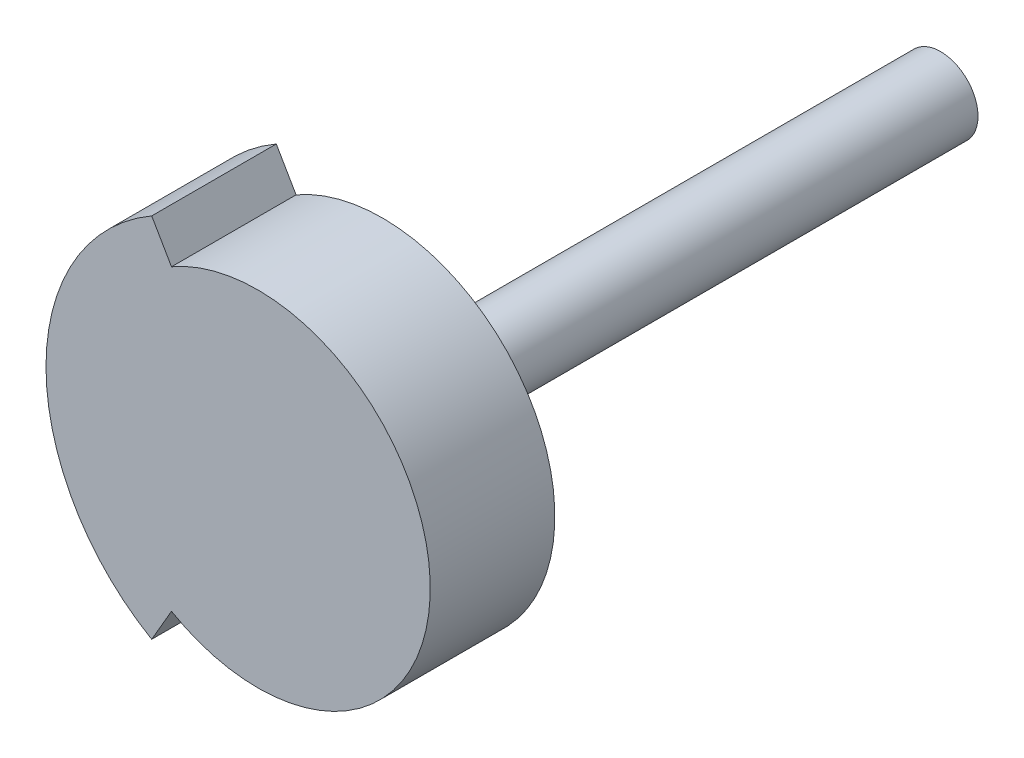
ISO-10303-21;
HEADER;
FILE_DESCRIPTION(('STEP AP214'),'2;1');
FILE_NAME('part.step','',(''),(''),'','','');
FILE_SCHEMA(('AUTOMOTIVE_DESIGN { 1 0 10303 214 1 1 1 1 }'));
ENDSEC;
DATA;
#1=APPLICATION_CONTEXT('core data for automotive mechanical design processes');
#2=APPLICATION_PROTOCOL_DEFINITION('international standard','automotive_design',2000,#1);
#3=PRODUCT_CONTEXT('',#1,'mechanical');
#4=PRODUCT('Part','Part','',(#3));
#5=PRODUCT_RELATED_PRODUCT_CATEGORY('part','',(#4));
#6=PRODUCT_DEFINITION_FORMATION('','',#4);
#7=PRODUCT_DEFINITION_CONTEXT('part definition',#1,'design');
#8=PRODUCT_DEFINITION('design','',#6,#7);
#9=PRODUCT_DEFINITION_SHAPE('','',#8);
#10=(LENGTH_UNIT() NAMED_UNIT(*) SI_UNIT(.MILLI.,.METRE.));
#11=(NAMED_UNIT(*) PLANE_ANGLE_UNIT() SI_UNIT($,.RADIAN.));
#12=(NAMED_UNIT(*) SI_UNIT($,.STERADIAN.) SOLID_ANGLE_UNIT());
#13=UNCERTAINTY_MEASURE_WITH_UNIT(LENGTH_MEASURE(1.E-05),#10,'distance_accuracy_value','');
#14=(GEOMETRIC_REPRESENTATION_CONTEXT(3) GLOBAL_UNCERTAINTY_ASSIGNED_CONTEXT((#13)) GLOBAL_UNIT_ASSIGNED_CONTEXT((#10,
#11,#12)) REPRESENTATION_CONTEXT('',''));
#15=CARTESIAN_POINT('',(0.,0.,0.));
#16=DIRECTION('',(0.,0.,1.));
#17=DIRECTION('',(1.,0.,0.));
#18=AXIS2_PLACEMENT_3D('',#15,#16,#17);
#19=CARTESIAN_POINT('',(7.25,0.,-11.2));
#20=DIRECTION('',(0.,0.,-1.));
#21=DIRECTION('',(-1.,0.,0.));
#22=AXIS2_PLACEMENT_3D('',#19,#20,#21);
#23=PLANE('',#22);
#24=CARTESIAN_POINT('',(7.25,0.,-11.2));
#25=DIRECTION('',(0.,0.,1.));
#26=DIRECTION('',(1.,0.,0.));
#27=AXIS2_PLACEMENT_3D('',#24,#25,#26);
#28=CIRCLE('',#27,0.750000000000001);
#29=CARTESIAN_POINT('',(8.,0.,-11.2));
#30=VERTEX_POINT('',#29);
#31=EDGE_CURVE('E19',#30,#30,#28,.T.);
#32=ORIENTED_EDGE('',*,*,#31,.F.);
#33=EDGE_LOOP('',(#32));
#34=FACE_BOUND('',#33,.T.);
#35=ADVANCED_FACE('F16',(#34),#23,.T.);
#36=CARTESIAN_POINT('',(7.25,0.,-11.2));
#37=DIRECTION('',(0.,0.,1.));
#38=DIRECTION('',(1.,0.,0.));
#39=AXIS2_PLACEMENT_3D('',#36,#37,#38);
#40=CYLINDRICAL_SURFACE('',#39,0.750000000000001);
#41=ORIENTED_EDGE('',*,*,#31,.T.);
#42=EDGE_LOOP('',(#41));
#43=FACE_BOUND('',#42,.T.);
#44=CARTESIAN_POINT('',(7.25,0.,0.));
#45=DIRECTION('',(0.,0.,1.));
#46=DIRECTION('',(1.,0.,0.));
#47=AXIS2_PLACEMENT_3D('',#44,#45,#46);
#48=CIRCLE('',#47,0.750000000000001);
#49=CARTESIAN_POINT('',(8.,0.,0.));
#50=VERTEX_POINT('',#49);
#51=EDGE_CURVE('E66',#50,#50,#48,.F.);
#52=ORIENTED_EDGE('',*,*,#51,.T.);
#53=EDGE_LOOP('',(#52));
#54=FACE_BOUND('',#53,.T.);
#55=ADVANCED_FACE('F149',(#43,#54),#40,.T.);
#56=CARTESIAN_POINT('',(5.51651328588162,2.99327707531385,0.));
#57=DIRECTION('',(0.86535898246922,0.501152503196218,0.));
#58=DIRECTION('',(-0.501152503196218,0.86535898246922,0.));
#59=AXIS2_PLACEMENT_3D('',#56,#57,#58);
#60=PLANE('',#59);
#61=DIRECTION('',(-0.501152503196218,0.865358982469221,0.));
#62=VECTOR('',#61,1.);
#63=CARTESIAN_POINT('',(5.51651328588162,2.99327707531385,0.));
#64=LINE('',#63,#62);
#65=CARTESIAN_POINT('',(5.51651328588162,2.99327707531385,0.));
#66=VERTEX_POINT('',#65);
#67=CARTESIAN_POINT('',(5.11929310356726,3.67917218826155,0.));
#68=VERTEX_POINT('',#67);
#69=EDGE_CURVE('E57',#66,#68,#64,.T.);
#70=ORIENTED_EDGE('',*,*,#69,.T.);
#71=DIRECTION('',(0.,0.,1.));
#72=VECTOR('',#71,1.);
#73=CARTESIAN_POINT('',(5.11929310356726,3.67917218826155,0.));
#74=LINE('',#73,#72);
#75=CARTESIAN_POINT('',(5.11929310356726,3.67917218826155,2.5));
#76=VERTEX_POINT('',#75);
#77=EDGE_CURVE('E94',#76,#68,#74,.F.);
#78=ORIENTED_EDGE('',*,*,#77,.F.);
#79=DIRECTION('',(-0.501152503196218,0.86535898246922,0.));
#80=VECTOR('',#79,1.);
#81=CARTESIAN_POINT('',(5.51651328588162,2.99327707531385,2.5));
#82=LINE('',#81,#80);
#83=CARTESIAN_POINT('',(5.51651328588162,2.99327707531385,2.5));
#84=VERTEX_POINT('',#83);
#85=EDGE_CURVE('E71',#76,#84,#82,.F.);
#86=ORIENTED_EDGE('',*,*,#85,.T.);
#87=DIRECTION('',(0.,0.,-1.));
#88=VECTOR('',#87,1.);
#89=CARTESIAN_POINT('',(5.51651328588162,2.99327707531385,2.5));
#90=LINE('',#89,#88);
#91=EDGE_CURVE('E69',#66,#84,#90,.F.);
#92=ORIENTED_EDGE('',*,*,#91,.F.);
#93=EDGE_LOOP('',(#70,#78,#86,#92));
#94=FACE_BOUND('',#93,.T.);
#95=ADVANCED_FACE('F70',(#94),#60,.T.);
#96=CARTESIAN_POINT('',(7.25,0.,0.));
#97=DIRECTION('',(0.,0.,1.));
#98=DIRECTION('',(1.,0.,0.));
#99=AXIS2_PLACEMENT_3D('',#96,#97,#98);
#100=PLANE('',#99);
#101=DIRECTION('',(0.501152503196218,0.86535898246922,0.));
#102=VECTOR('',#101,1.);
#103=CARTESIAN_POINT('',(5.11929310356726,-3.67917218826155,0.));
#104=LINE('',#103,#102);
#105=CARTESIAN_POINT('',(5.11929310356726,-3.67917218826155,0.));
#106=VERTEX_POINT('',#105);
#107=CARTESIAN_POINT('',(5.51651328588162,-2.99327707531385,0.));
#108=VERTEX_POINT('',#107);
#109=EDGE_CURVE('E79',#106,#108,#104,.T.);
#110=ORIENTED_EDGE('',*,*,#109,.F.);
#111=CARTESIAN_POINT('',(7.25,0.,0.));
#112=DIRECTION('',(0.,0.,1.));
#113=DIRECTION('',(1.,0.,0.));
#114=AXIS2_PLACEMENT_3D('',#111,#112,#113);
#115=CIRCLE('',#114,4.25161379588778);
#116=EDGE_CURVE('E62',#68,#106,#115,.T.);
#117=ORIENTED_EDGE('',*,*,#116,.F.);
#118=ORIENTED_EDGE('',*,*,#69,.F.);
#119=CARTESIAN_POINT('',(7.25,0.,0.));
#120=DIRECTION('',(0.,0.,-1.));
#121=DIRECTION('',(-1.,0.,0.));
#122=AXIS2_PLACEMENT_3D('',#119,#120,#121);
#123=CIRCLE('',#122,3.45900041017985);
#124=EDGE_CURVE('E54',#108,#66,#123,.F.);
#125=ORIENTED_EDGE('',*,*,#124,.F.);
#126=EDGE_LOOP('',(#110,#117,#118,#125));
#127=FACE_BOUND('',#126,.T.);
#128=ORIENTED_EDGE('',*,*,#51,.F.);
#129=EDGE_LOOP('',(#128));
#130=FACE_BOUND('',#129,.T.);
#131=ADVANCED_FACE('F59',(#127,#130),#100,.F.);
#132=CARTESIAN_POINT('',(5.11929310356726,-3.67917218826155,0.));
#133=DIRECTION('',(0.86535898246922,-0.501152503196218,0.));
#134=DIRECTION('',(0.501152503196218,0.86535898246922,0.));
#135=AXIS2_PLACEMENT_3D('',#132,#133,#134);
#136=PLANE('',#135);
#137=ORIENTED_EDGE('',*,*,#109,.T.);
#138=DIRECTION('',(0.,0.,-1.));
#139=VECTOR('',#138,1.);
#140=CARTESIAN_POINT('',(5.51651328588162,-2.99327707531385,2.5));
#141=LINE('',#140,#139);
#142=CARTESIAN_POINT('',(5.51651328588162,-2.99327707531385,2.5));
#143=VERTEX_POINT('',#142);
#144=EDGE_CURVE('E75',#143,#108,#141,.T.);
#145=ORIENTED_EDGE('',*,*,#144,.F.);
#146=DIRECTION('',(0.501152503196218,0.86535898246922,0.));
#147=VECTOR('',#146,1.);
#148=CARTESIAN_POINT('',(5.11929310356726,-3.67917218826155,2.5));
#149=LINE('',#148,#147);
#150=CARTESIAN_POINT('',(5.11929310356726,-3.67917218826155,2.5));
#151=VERTEX_POINT('',#150);
#152=EDGE_CURVE('E34',#143,#151,#149,.F.);
#153=ORIENTED_EDGE('',*,*,#152,.T.);
#154=DIRECTION('',(0.,0.,1.));
#155=VECTOR('',#154,1.);
#156=CARTESIAN_POINT('',(5.11929310356726,-3.67917218826155,0.));
#157=LINE('',#156,#155);
#158=EDGE_CURVE('E89',#106,#151,#157,.T.);
#159=ORIENTED_EDGE('',*,*,#158,.F.);
#160=EDGE_LOOP('',(#137,#145,#153,#159));
#161=FACE_BOUND('',#160,.T.);
#162=ADVANCED_FACE('F100',(#161),#136,.T.);
#163=CARTESIAN_POINT('',(7.25,0.,2.5));
#164=DIRECTION('',(0.,0.,-1.));
#165=DIRECTION('',(-1.,0.,0.));
#166=AXIS2_PLACEMENT_3D('',#163,#164,#165);
#167=CYLINDRICAL_SURFACE('',#166,3.45900041017985);
#168=CARTESIAN_POINT('',(7.25,0.,2.5));
#169=DIRECTION('',(0.,0.,-1.));
#170=DIRECTION('',(-1.,0.,0.));
#171=AXIS2_PLACEMENT_3D('',#168,#169,#170);
#172=CIRCLE('',#171,3.45900041017985);
#173=EDGE_CURVE('E25',#143,#84,#172,.F.);
#174=ORIENTED_EDGE('',*,*,#173,.F.);
#175=ORIENTED_EDGE('',*,*,#144,.T.);
#176=ORIENTED_EDGE('',*,*,#124,.T.);
#177=ORIENTED_EDGE('',*,*,#91,.T.);
#178=EDGE_LOOP('',(#174,#175,#176,#177));
#179=FACE_BOUND('',#178,.T.);
#180=ADVANCED_FACE('F78',(#179),#167,.T.);
#181=CARTESIAN_POINT('',(7.25,0.,0.));
#182=DIRECTION('',(0.,0.,1.));
#183=DIRECTION('',(1.,0.,0.));
#184=AXIS2_PLACEMENT_3D('',#181,#182,#183);
#185=CYLINDRICAL_SURFACE('',#184,4.25161379588778);
#186=ORIENTED_EDGE('',*,*,#116,.T.);
#187=ORIENTED_EDGE('',*,*,#158,.T.);
#188=CARTESIAN_POINT('',(7.25,0.,2.5));
#189=DIRECTION('',(0.,0.,1.));
#190=DIRECTION('',(1.,0.,0.));
#191=AXIS2_PLACEMENT_3D('',#188,#189,#190);
#192=CIRCLE('',#191,4.25161379588778);
#193=EDGE_CURVE('E11',#76,#151,#192,.T.);
#194=ORIENTED_EDGE('',*,*,#193,.F.);
#195=ORIENTED_EDGE('',*,*,#77,.T.);
#196=EDGE_LOOP('',(#186,#187,#194,#195));
#197=FACE_BOUND('',#196,.T.);
#198=ADVANCED_FACE('F98',(#197),#185,.T.);
#199=CARTESIAN_POINT('',(7.25,0.,2.5));
#200=DIRECTION('',(0.,0.,1.));
#201=DIRECTION('',(1.,0.,0.));
#202=AXIS2_PLACEMENT_3D('',#199,#200,#201);
#203=PLANE('',#202);
#204=ORIENTED_EDGE('',*,*,#193,.T.);
#205=ORIENTED_EDGE('',*,*,#152,.F.);
#206=ORIENTED_EDGE('',*,*,#173,.T.);
#207=ORIENTED_EDGE('',*,*,#85,.F.);
#208=EDGE_LOOP('',(#204,#205,#206,#207));
#209=FACE_BOUND('',#208,.T.);
#210=ADVANCED_FACE('F99',(#209),#203,.T.);
#211=CLOSED_SHELL('',(#35,#55,#95,#131,#162,#180,#198,#210));
#212=MANIFOLD_SOLID_BREP('B1',#211);
#213=ADVANCED_BREP_SHAPE_REPRESENTATION('',(#18,#212),#14);
#214=SHAPE_DEFINITION_REPRESENTATION(#9,#213);
ENDSEC;
END-ISO-10303-21;
